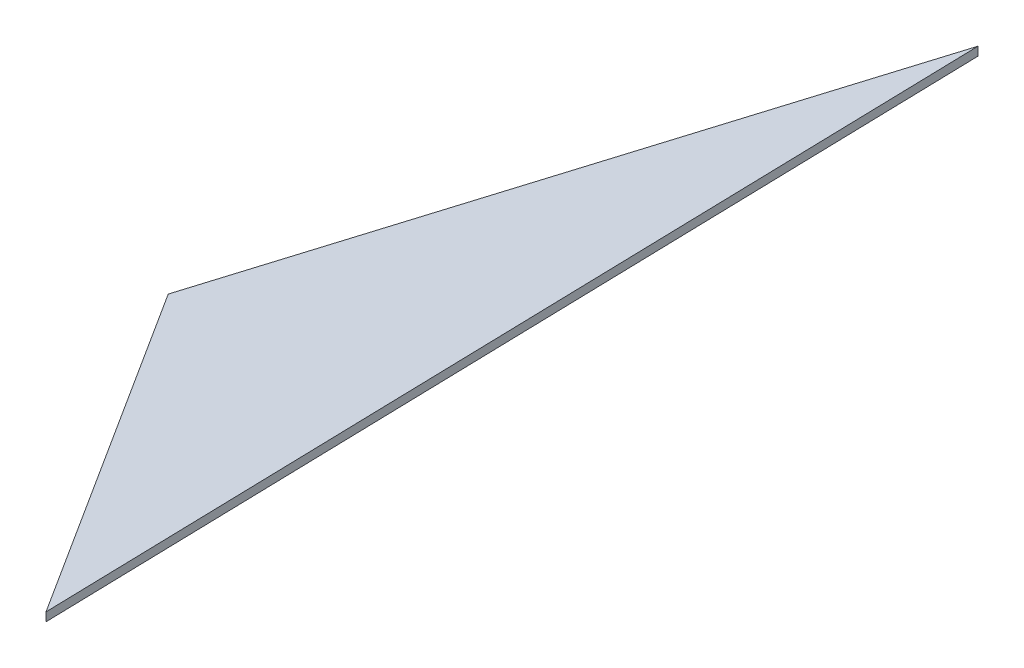
ISO-10303-21;
HEADER;
FILE_DESCRIPTION(('STEP AP214'),'2;1');
FILE_NAME('part.step','',(''),(''),'','','');
FILE_SCHEMA(('AUTOMOTIVE_DESIGN { 1 0 10303 214 1 1 1 1 }'));
ENDSEC;
DATA;
#1=APPLICATION_CONTEXT('core data for automotive mechanical design processes');
#2=APPLICATION_PROTOCOL_DEFINITION('international standard','automotive_design',2000,#1);
#3=PRODUCT_CONTEXT('',#1,'mechanical');
#4=PRODUCT('Part','Part','',(#3));
#5=PRODUCT_RELATED_PRODUCT_CATEGORY('part','',(#4));
#6=PRODUCT_DEFINITION_FORMATION('','',#4);
#7=PRODUCT_DEFINITION_CONTEXT('part definition',#1,'design');
#8=PRODUCT_DEFINITION('design','',#6,#7);
#9=PRODUCT_DEFINITION_SHAPE('','',#8);
#10=(LENGTH_UNIT() NAMED_UNIT(*) SI_UNIT(.MILLI.,.METRE.));
#11=(NAMED_UNIT(*) PLANE_ANGLE_UNIT() SI_UNIT($,.RADIAN.));
#12=(NAMED_UNIT(*) SI_UNIT($,.STERADIAN.) SOLID_ANGLE_UNIT());
#13=UNCERTAINTY_MEASURE_WITH_UNIT(LENGTH_MEASURE(1.E-05),#10,'distance_accuracy_value','');
#14=(GEOMETRIC_REPRESENTATION_CONTEXT(3) GLOBAL_UNCERTAINTY_ASSIGNED_CONTEXT((#13)) GLOBAL_UNIT_ASSIGNED_CONTEXT((#10,
#11,#12)) REPRESENTATION_CONTEXT('',''));
#15=CARTESIAN_POINT('',(0.,0.,0.));
#16=DIRECTION('',(0.,0.,1.));
#17=DIRECTION('',(1.,0.,0.));
#18=AXIS2_PLACEMENT_3D('',#15,#16,#17);
#19=CARTESIAN_POINT('',(49.5560866825733,2.,77.8448346030884));
#20=DIRECTION('',(-0.999687659465366,0.,0.024991668865));
#21=DIRECTION('',(0.024991668865,0.,0.999687659465366));
#22=AXIS2_PLACEMENT_3D('',#19,#20,#21);
#23=PLANE('',#22);
#24=DIRECTION('',(-0.024991668865,0.,-0.999687659465366));
#25=VECTOR('',#24,1.);
#26=CARTESIAN_POINT('',(49.5560866825733,0.,77.8448346030884));
#27=LINE('',#26,#25);
#28=CARTESIAN_POINT('',(49.5560866825733,0.,77.8448346030884));
#29=VERTEX_POINT('',#28);
#30=CARTESIAN_POINT('',(44.0248082637945,0.,-143.410928915141));
#31=VERTEX_POINT('',#30);
#32=EDGE_CURVE('E89',#29,#31,#27,.T.);
#33=ORIENTED_EDGE('',*,*,#32,.T.);
#34=DIRECTION('',(0.,-1.,0.));
#35=VECTOR('',#34,1.);
#36=CARTESIAN_POINT('',(44.0248082637945,2.,-143.410928915141));
#37=LINE('',#36,#35);
#38=CARTESIAN_POINT('',(44.0248082637945,2.,-143.410928915141));
#39=VERTEX_POINT('',#38);
#40=EDGE_CURVE('E11',#39,#31,#37,.T.);
#41=ORIENTED_EDGE('',*,*,#40,.F.);
#42=DIRECTION('',(-0.024991668865,0.,-0.999687659465366));
#43=VECTOR('',#42,1.);
#44=CARTESIAN_POINT('',(49.5560866825733,2.,77.8448346030884));
#45=LINE('',#44,#43);
#46=CARTESIAN_POINT('',(49.5560866825733,2.,77.8448346030884));
#47=VERTEX_POINT('',#46);
#48=EDGE_CURVE('E81',#47,#39,#45,.T.);
#49=ORIENTED_EDGE('',*,*,#48,.F.);
#50=DIRECTION('',(0.,-1.,0.));
#51=VECTOR('',#50,1.);
#52=CARTESIAN_POINT('',(49.5560866825733,2.,77.8448346030884));
#53=LINE('',#52,#51);
#54=EDGE_CURVE('E90',#47,#29,#53,.T.);
#55=ORIENTED_EDGE('',*,*,#54,.T.);
#56=EDGE_LOOP('',(#33,#41,#49,#55));
#57=FACE_BOUND('',#56,.T.);
#58=ADVANCED_FACE('F39',(#57),#23,.F.);
#59=CARTESIAN_POINT('',(44.0248082637945,2.,-143.410928915141));
#60=DIRECTION('',(0.955969232144777,0.,0.293466909876609));
#61=DIRECTION('',(0.293466909876609,0.,-0.955969232144777));
#62=AXIS2_PLACEMENT_3D('',#59,#60,#61);
#63=PLANE('',#62);
#64=DIRECTION('',(-0.293466909876609,0.,0.955969232144777));
#65=VECTOR('',#64,1.);
#66=CARTESIAN_POINT('',(44.0248082637945,0.,-143.410928915141));
#67=LINE('',#66,#65);
#68=CARTESIAN_POINT('',(0.,0.,0.));
#69=VERTEX_POINT('',#68);
#70=EDGE_CURVE('E68',#31,#69,#67,.T.);
#71=ORIENTED_EDGE('',*,*,#70,.T.);
#72=DIRECTION('',(0.,-1.,0.));
#73=VECTOR('',#72,1.);
#74=CARTESIAN_POINT('',(0.,2.,0.));
#75=LINE('',#74,#73);
#76=CARTESIAN_POINT('',(0.,2.,0.));
#77=VERTEX_POINT('',#76);
#78=EDGE_CURVE('E48',#77,#69,#75,.T.);
#79=ORIENTED_EDGE('',*,*,#78,.F.);
#80=DIRECTION('',(-0.293466909876609,0.,0.955969232144777));
#81=VECTOR('',#80,1.);
#82=CARTESIAN_POINT('',(44.0248082637945,2.,-143.410928915141));
#83=LINE('',#82,#81);
#84=EDGE_CURVE('E76',#39,#77,#83,.T.);
#85=ORIENTED_EDGE('',*,*,#84,.F.);
#86=ORIENTED_EDGE('',*,*,#40,.T.);
#87=EDGE_LOOP('',(#71,#79,#85,#86));
#88=FACE_BOUND('',#87,.T.);
#89=ADVANCED_FACE('F77',(#88),#63,.F.);
#90=CARTESIAN_POINT('',(0.,2.,0.));
#91=DIRECTION('',(0.84357084509395,0.,-0.537017904084658));
#92=DIRECTION('',(-0.537017904084658,0.,-0.84357084509395));
#93=AXIS2_PLACEMENT_3D('',#90,#91,#92);
#94=PLANE('',#93);
#95=DIRECTION('',(0.537017904084658,0.,0.84357084509395));
#96=VECTOR('',#95,1.);
#97=CARTESIAN_POINT('',(0.,0.,0.));
#98=LINE('',#97,#96);
#99=EDGE_CURVE('E73',#69,#29,#98,.T.);
#100=ORIENTED_EDGE('',*,*,#99,.T.);
#101=ORIENTED_EDGE('',*,*,#54,.F.);
#102=DIRECTION('',(0.537017904084658,0.,0.84357084509395));
#103=VECTOR('',#102,1.);
#104=CARTESIAN_POINT('',(0.,2.,0.));
#105=LINE('',#104,#103);
#106=EDGE_CURVE('E56',#77,#47,#105,.T.);
#107=ORIENTED_EDGE('',*,*,#106,.F.);
#108=ORIENTED_EDGE('',*,*,#78,.T.);
#109=EDGE_LOOP('',(#100,#101,#107,#108));
#110=FACE_BOUND('',#109,.T.);
#111=ADVANCED_FACE('F102',(#110),#94,.F.);
#112=CARTESIAN_POINT('',(0.,2.,0.));
#113=DIRECTION('',(0.,-1.,0.));
#114=DIRECTION('',(0.,0.,-1.));
#115=AXIS2_PLACEMENT_3D('',#112,#113,#114);
#116=PLANE('',#115);
#117=ORIENTED_EDGE('',*,*,#48,.T.);
#118=ORIENTED_EDGE('',*,*,#84,.T.);
#119=ORIENTED_EDGE('',*,*,#106,.T.);
#120=EDGE_LOOP('',(#117,#118,#119));
#121=FACE_BOUND('',#120,.T.);
#122=ADVANCED_FACE('F84',(#121),#116,.F.);
#123=CARTESIAN_POINT('',(0.,0.,0.));
#124=DIRECTION('',(0.,-1.,0.));
#125=DIRECTION('',(0.,0.,-1.));
#126=AXIS2_PLACEMENT_3D('',#123,#124,#125);
#127=PLANE('',#126);
#128=ORIENTED_EDGE('',*,*,#32,.F.);
#129=ORIENTED_EDGE('',*,*,#99,.F.);
#130=ORIENTED_EDGE('',*,*,#70,.F.);
#131=EDGE_LOOP('',(#128,#129,#130));
#132=FACE_BOUND('',#131,.T.);
#133=ADVANCED_FACE('F103',(#132),#127,.T.);
#134=CLOSED_SHELL('',(#58,#89,#111,#122,#133));
#135=MANIFOLD_SOLID_BREP('B2',#134);
#136=ADVANCED_BREP_SHAPE_REPRESENTATION('',(#18,#135),#14);
#137=SHAPE_DEFINITION_REPRESENTATION(#9,#136);
ENDSEC;
END-ISO-10303-21;
